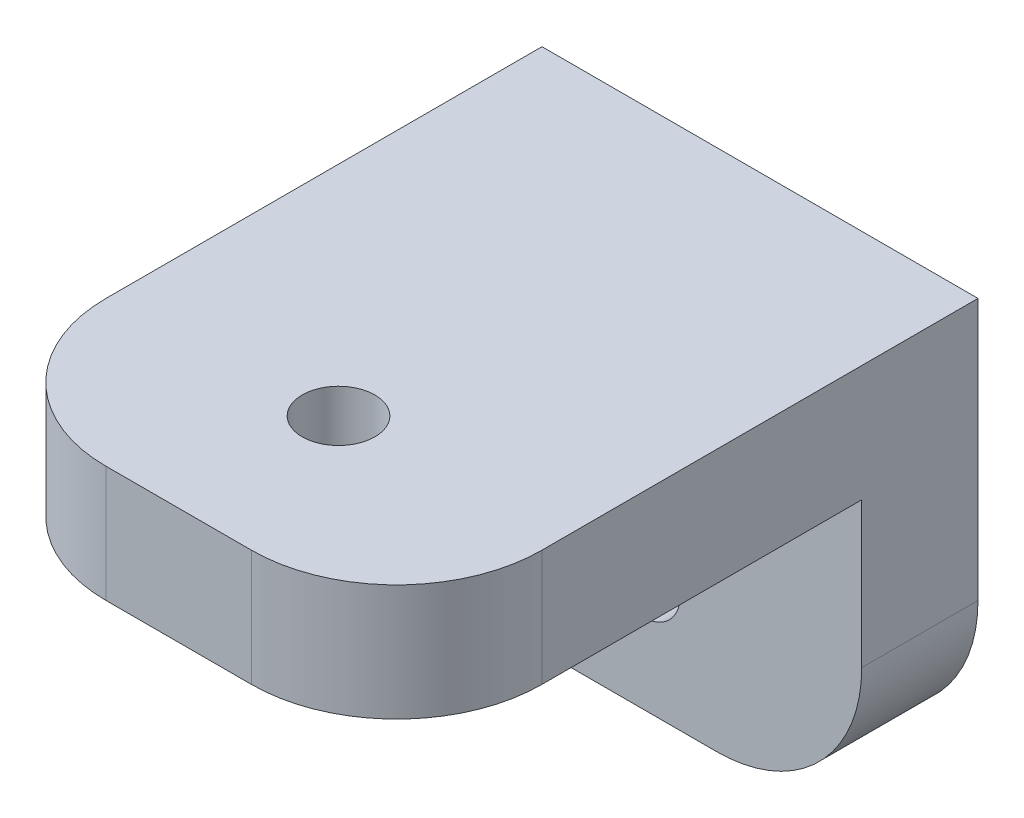
ISO-10303-21;
HEADER;
FILE_DESCRIPTION(('STEP AP214'),'2;1');
FILE_NAME('part.step','',(''),(''),'','','');
FILE_SCHEMA(('AUTOMOTIVE_DESIGN { 1 0 10303 214 1 1 1 1 }'));
ENDSEC;
DATA;
#1=APPLICATION_CONTEXT('core data for automotive mechanical design processes');
#2=APPLICATION_PROTOCOL_DEFINITION('international standard','automotive_design',2000,#1);
#3=PRODUCT_CONTEXT('',#1,'mechanical');
#4=PRODUCT('Part','Part','',(#3));
#5=PRODUCT_RELATED_PRODUCT_CATEGORY('part','',(#4));
#6=PRODUCT_DEFINITION_FORMATION('','',#4);
#7=PRODUCT_DEFINITION_CONTEXT('part definition',#1,'design');
#8=PRODUCT_DEFINITION('design','',#6,#7);
#9=PRODUCT_DEFINITION_SHAPE('','',#8);
#10=(LENGTH_UNIT() NAMED_UNIT(*) SI_UNIT(.MILLI.,.METRE.));
#11=(NAMED_UNIT(*) PLANE_ANGLE_UNIT() SI_UNIT($,.RADIAN.));
#12=(NAMED_UNIT(*) SI_UNIT($,.STERADIAN.) SOLID_ANGLE_UNIT());
#13=UNCERTAINTY_MEASURE_WITH_UNIT(LENGTH_MEASURE(1.E-05),#10,'distance_accuracy_value','');
#14=(GEOMETRIC_REPRESENTATION_CONTEXT(3) GLOBAL_UNCERTAINTY_ASSIGNED_CONTEXT((#13)) GLOBAL_UNIT_ASSIGNED_CONTEXT((#10,
#11,#12)) REPRESENTATION_CONTEXT('',''));
#15=CARTESIAN_POINT('',(0.,0.,0.));
#16=DIRECTION('',(0.,0.,1.));
#17=DIRECTION('',(1.,0.,0.));
#18=AXIS2_PLACEMENT_3D('',#15,#16,#17);
#19=CARTESIAN_POINT('',(0.,8.,0.));
#20=DIRECTION('',(1.,0.,0.));
#21=DIRECTION('',(0.,0.,-1.));
#22=AXIS2_PLACEMENT_3D('',#19,#20,#21);
#23=PLANE('',#22);
#24=DIRECTION('',(0.,-1.,0.));
#25=VECTOR('',#24,1.);
#26=CARTESIAN_POINT('',(0.,8.,-40.));
#27=LINE('',#26,#25);
#28=CARTESIAN_POINT('',(0.,8.,-40.));
#29=VERTEX_POINT('',#28);
#30=CARTESIAN_POINT('',(0.,-9.99999999999999,-40.));
#31=VERTEX_POINT('',#30);
#32=EDGE_CURVE('E172',#29,#31,#27,.T.);
#33=ORIENTED_EDGE('',*,*,#32,.T.);
#34=DIRECTION('',(0.,0.,-1.));
#35=VECTOR('',#34,1.);
#36=CARTESIAN_POINT('',(0.,-9.99999999999999,0.));
#37=LINE('',#36,#35);
#38=CARTESIAN_POINT('',(0.,-10.,-32.));
#39=VERTEX_POINT('',#38);
#40=EDGE_CURVE('E123',#31,#39,#37,.F.);
#41=ORIENTED_EDGE('',*,*,#40,.T.);
#42=DIRECTION('',(0.,1.,0.));
#43=VECTOR('',#42,1.);
#44=CARTESIAN_POINT('',(0.,-20.,-32.));
#45=LINE('',#44,#43);
#46=CARTESIAN_POINT('',(0.,0.,-32.));
#47=VERTEX_POINT('',#46);
#48=EDGE_CURVE('E117',#39,#47,#45,.T.);
#49=ORIENTED_EDGE('',*,*,#48,.T.);
#50=DIRECTION('',(0.,0.,1.));
#51=VECTOR('',#50,1.);
#52=CARTESIAN_POINT('',(0.,0.,0.));
#53=LINE('',#52,#51);
#54=CARTESIAN_POINT('',(0.,0.,-10.));
#55=VERTEX_POINT('',#54);
#56=EDGE_CURVE('E120',#47,#55,#53,.T.);
#57=ORIENTED_EDGE('',*,*,#56,.T.);
#58=DIRECTION('',(0.,-1.,0.));
#59=VECTOR('',#58,1.);
#60=CARTESIAN_POINT('',(0.,8.,-10.));
#61=LINE('',#60,#59);
#62=CARTESIAN_POINT('',(0.,8.,-10.));
#63=VERTEX_POINT('',#62);
#64=EDGE_CURVE('E216',#55,#63,#61,.F.);
#65=ORIENTED_EDGE('',*,*,#64,.T.);
#66=DIRECTION('',(0.,0.,1.));
#67=VECTOR('',#66,1.);
#68=CARTESIAN_POINT('',(0.,8.,0.));
#69=LINE('',#68,#67);
#70=EDGE_CURVE('E160',#29,#63,#69,.T.);
#71=ORIENTED_EDGE('',*,*,#70,.F.);
#72=EDGE_LOOP('',(#33,#41,#49,#57,#65,#71));
#73=FACE_BOUND('',#72,.T.);
#74=ADVANCED_FACE('F39',(#73),#23,.F.);
#75=CARTESIAN_POINT('',(0.,8.,0.));
#76=DIRECTION('',(0.,0.,-1.));
#77=DIRECTION('',(-1.,0.,0.));
#78=AXIS2_PLACEMENT_3D('',#75,#76,#77);
#79=PLANE('',#78);
#80=DIRECTION('',(1.,0.,0.));
#81=VECTOR('',#80,1.);
#82=CARTESIAN_POINT('',(0.,8.,0.));
#83=LINE('',#82,#81);
#84=CARTESIAN_POINT('',(10.,8.,0.));
#85=VERTEX_POINT('',#84);
#86=CARTESIAN_POINT('',(20.,8.,0.));
#87=VERTEX_POINT('',#86);
#88=EDGE_CURVE('E163',#85,#87,#83,.T.);
#89=ORIENTED_EDGE('',*,*,#88,.F.);
#90=DIRECTION('',(0.,-1.,0.));
#91=VECTOR('',#90,1.);
#92=CARTESIAN_POINT('',(10.,8.,0.));
#93=LINE('',#92,#91);
#94=CARTESIAN_POINT('',(10.,0.,0.));
#95=VERTEX_POINT('',#94);
#96=EDGE_CURVE('E223',#85,#95,#93,.T.);
#97=ORIENTED_EDGE('',*,*,#96,.T.);
#98=DIRECTION('',(1.,0.,0.));
#99=VECTOR('',#98,1.);
#100=CARTESIAN_POINT('',(0.,0.,0.));
#101=LINE('',#100,#99);
#102=CARTESIAN_POINT('',(20.,0.,0.));
#103=VERTEX_POINT('',#102);
#104=EDGE_CURVE('E139',#95,#103,#101,.T.);
#105=ORIENTED_EDGE('',*,*,#104,.T.);
#106=DIRECTION('',(0.,-1.,0.));
#107=VECTOR('',#106,1.);
#108=CARTESIAN_POINT('',(20.,8.,0.));
#109=LINE('',#108,#107);
#110=EDGE_CURVE('E55',#103,#87,#109,.F.);
#111=ORIENTED_EDGE('',*,*,#110,.T.);
#112=EDGE_LOOP('',(#89,#97,#105,#111));
#113=FACE_BOUND('',#112,.T.);
#114=ADVANCED_FACE('F241',(#113),#79,.F.);
#115=CARTESIAN_POINT('',(30.,8.,0.));
#116=DIRECTION('',(-1.,0.,0.));
#117=DIRECTION('',(0.,0.,1.));
#118=AXIS2_PLACEMENT_3D('',#115,#116,#117);
#119=PLANE('',#118);
#120=DIRECTION('',(0.,1.,0.));
#121=VECTOR('',#120,1.);
#122=CARTESIAN_POINT('',(30.,-20.,-32.));
#123=LINE('',#122,#121);
#124=CARTESIAN_POINT('',(30.,-10.,-32.));
#125=VERTEX_POINT('',#124);
#126=CARTESIAN_POINT('',(30.,0.,-32.));
#127=VERTEX_POINT('',#126);
#128=EDGE_CURVE('E128',#125,#127,#123,.T.);
#129=ORIENTED_EDGE('',*,*,#128,.F.);
#130=DIRECTION('',(0.,0.,1.));
#131=VECTOR('',#130,1.);
#132=CARTESIAN_POINT('',(30.,-9.99999999999999,0.));
#133=LINE('',#132,#131);
#134=CARTESIAN_POINT('',(30.,-9.99999999999999,-40.));
#135=VERTEX_POINT('',#134);
#136=EDGE_CURVE('E207',#125,#135,#133,.F.);
#137=ORIENTED_EDGE('',*,*,#136,.T.);
#138=DIRECTION('',(0.,-1.,0.));
#139=VECTOR('',#138,1.);
#140=CARTESIAN_POINT('',(30.,8.,-40.));
#141=LINE('',#140,#139);
#142=CARTESIAN_POINT('',(30.,8.,-40.));
#143=VERTEX_POINT('',#142);
#144=EDGE_CURVE('E180',#143,#135,#141,.T.);
#145=ORIENTED_EDGE('',*,*,#144,.F.);
#146=DIRECTION('',(0.,0.,-1.));
#147=VECTOR('',#146,1.);
#148=CARTESIAN_POINT('',(30.,8.,0.));
#149=LINE('',#148,#147);
#150=CARTESIAN_POINT('',(30.,8.,-10.));
#151=VERTEX_POINT('',#150);
#152=EDGE_CURVE('E167',#151,#143,#149,.T.);
#153=ORIENTED_EDGE('',*,*,#152,.F.);
#154=DIRECTION('',(0.,-1.,0.));
#155=VECTOR('',#154,1.);
#156=CARTESIAN_POINT('',(30.,8.,-10.));
#157=LINE('',#156,#155);
#158=CARTESIAN_POINT('',(30.,0.,-10.));
#159=VERTEX_POINT('',#158);
#160=EDGE_CURVE('E203',#151,#159,#157,.T.);
#161=ORIENTED_EDGE('',*,*,#160,.T.);
#162=DIRECTION('',(0.,0.,-1.));
#163=VECTOR('',#162,1.);
#164=CARTESIAN_POINT('',(30.,0.,0.));
#165=LINE('',#164,#163);
#166=EDGE_CURVE('E164',#159,#127,#165,.T.);
#167=ORIENTED_EDGE('',*,*,#166,.T.);
#168=EDGE_LOOP('',(#129,#137,#145,#153,#161,#167));
#169=FACE_BOUND('',#168,.T.);
#170=ADVANCED_FACE('F239',(#169),#119,.F.);
#171=CARTESIAN_POINT('',(0.,8.,-40.));
#172=DIRECTION('',(0.,0.,1.));
#173=DIRECTION('',(1.,0.,0.));
#174=AXIS2_PLACEMENT_3D('',#171,#172,#173);
#175=PLANE('',#174);
#176=CARTESIAN_POINT('',(15.,-12.,-40.));
#177=DIRECTION('',(0.,0.,-1.));
#178=DIRECTION('',(-1.,0.,0.));
#179=AXIS2_PLACEMENT_3D('',#176,#177,#178);
#180=CIRCLE('',#179,2.5);
#181=CARTESIAN_POINT('',(12.5,-12.,-40.));
#182=VERTEX_POINT('',#181);
#183=EDGE_CURVE('E189',#182,#182,#180,.T.);
#184=ORIENTED_EDGE('',*,*,#183,.F.);
#185=EDGE_LOOP('',(#184));
#186=FACE_BOUND('',#185,.T.);
#187=ORIENTED_EDGE('',*,*,#144,.T.);
#188=CARTESIAN_POINT('',(20.,-10.,-40.));
#189=DIRECTION('',(0.,0.,1.));
#190=DIRECTION('',(1.,0.,0.));
#191=AXIS2_PLACEMENT_3D('',#188,#189,#190);
#192=CIRCLE('',#191,10.);
#193=CARTESIAN_POINT('',(20.,-20.,-40.));
#194=VERTEX_POINT('',#193);
#195=EDGE_CURVE('E213',#135,#194,#192,.F.);
#196=ORIENTED_EDGE('',*,*,#195,.T.);
#197=DIRECTION('',(1.,0.,0.));
#198=VECTOR('',#197,1.);
#199=CARTESIAN_POINT('',(0.,-20.,-40.));
#200=LINE('',#199,#198);
#201=CARTESIAN_POINT('',(10.,-20.,-40.));
#202=VERTEX_POINT('',#201);
#203=EDGE_CURVE('E146',#202,#194,#200,.T.);
#204=ORIENTED_EDGE('',*,*,#203,.F.);
#205=CARTESIAN_POINT('',(10.,-10.,-40.));
#206=DIRECTION('',(0.,0.,1.));
#207=DIRECTION('',(1.,0.,0.));
#208=AXIS2_PLACEMENT_3D('',#205,#206,#207);
#209=CIRCLE('',#208,10.);
#210=EDGE_CURVE('E210',#202,#31,#209,.F.);
#211=ORIENTED_EDGE('',*,*,#210,.T.);
#212=ORIENTED_EDGE('',*,*,#32,.F.);
#213=DIRECTION('',(-1.,0.,0.));
#214=VECTOR('',#213,1.);
#215=CARTESIAN_POINT('',(0.,8.,-40.));
#216=LINE('',#215,#214);
#217=EDGE_CURVE('E170',#143,#29,#216,.T.);
#218=ORIENTED_EDGE('',*,*,#217,.F.);
#219=EDGE_LOOP('',(#187,#196,#204,#211,#212,#218));
#220=FACE_BOUND('',#219,.T.);
#221=ADVANCED_FACE('F248',(#186,#220),#175,.F.);
#222=CARTESIAN_POINT('',(0.,8.,0.));
#223=DIRECTION('',(0.,-1.,0.));
#224=DIRECTION('',(0.,0.,-1.));
#225=AXIS2_PLACEMENT_3D('',#222,#223,#224);
#226=PLANE('',#225);
#227=CARTESIAN_POINT('',(15.,8.,-11.));
#228=DIRECTION('',(0.,1.,0.));
#229=DIRECTION('',(0.,0.,1.));
#230=AXIS2_PLACEMENT_3D('',#227,#228,#229);
#231=CIRCLE('',#230,2.5);
#232=CARTESIAN_POINT('',(15.,8.,-8.5));
#233=VERTEX_POINT('',#232);
#234=EDGE_CURVE('E154',#233,#233,#231,.T.);
#235=ORIENTED_EDGE('',*,*,#234,.F.);
#236=EDGE_LOOP('',(#235));
#237=FACE_BOUND('',#236,.T.);
#238=ORIENTED_EDGE('',*,*,#70,.T.);
#239=CARTESIAN_POINT('',(10.,8.,-10.));
#240=DIRECTION('',(0.,-1.,0.));
#241=DIRECTION('',(0.,0.,-1.));
#242=AXIS2_PLACEMENT_3D('',#239,#240,#241);
#243=CIRCLE('',#242,10.);
#244=EDGE_CURVE('E11',#63,#85,#243,.F.);
#245=ORIENTED_EDGE('',*,*,#244,.T.);
#246=ORIENTED_EDGE('',*,*,#88,.T.);
#247=CARTESIAN_POINT('',(20.,8.,-10.));
#248=DIRECTION('',(0.,-1.,0.));
#249=DIRECTION('',(0.,0.,-1.));
#250=AXIS2_PLACEMENT_3D('',#247,#248,#249);
#251=CIRCLE('',#250,10.);
#252=EDGE_CURVE('E48',#87,#151,#251,.F.);
#253=ORIENTED_EDGE('',*,*,#252,.T.);
#254=ORIENTED_EDGE('',*,*,#152,.T.);
#255=ORIENTED_EDGE('',*,*,#217,.T.);
#256=EDGE_LOOP('',(#238,#245,#246,#253,#254,#255));
#257=FACE_BOUND('',#256,.T.);
#258=ADVANCED_FACE('F234',(#237,#257),#226,.F.);
#259=CARTESIAN_POINT('',(0.,0.,0.));
#260=DIRECTION('',(0.,-1.,0.));
#261=DIRECTION('',(0.,0.,-1.));
#262=AXIS2_PLACEMENT_3D('',#259,#260,#261);
#263=PLANE('',#262);
#264=CARTESIAN_POINT('',(15.,0.,-11.));
#265=DIRECTION('',(0.,-1.,0.));
#266=DIRECTION('',(0.,0.,-1.));
#267=AXIS2_PLACEMENT_3D('',#264,#265,#266);
#268=CIRCLE('',#267,2.5);
#269=CARTESIAN_POINT('',(15.,0.,-13.5));
#270=VERTEX_POINT('',#269);
#271=EDGE_CURVE('E147',#270,#270,#268,.T.);
#272=ORIENTED_EDGE('',*,*,#271,.F.);
#273=EDGE_LOOP('',(#272));
#274=FACE_BOUND('',#273,.T.);
#275=ORIENTED_EDGE('',*,*,#104,.F.);
#276=CARTESIAN_POINT('',(10.,0.,-10.));
#277=DIRECTION('',(0.,-1.,0.));
#278=DIRECTION('',(0.,0.,-1.));
#279=AXIS2_PLACEMENT_3D('',#276,#277,#278);
#280=CIRCLE('',#279,10.);
#281=EDGE_CURVE('E137',#95,#55,#280,.T.);
#282=ORIENTED_EDGE('',*,*,#281,.T.);
#283=ORIENTED_EDGE('',*,*,#56,.F.);
#284=DIRECTION('',(-1.,0.,0.));
#285=VECTOR('',#284,1.);
#286=CARTESIAN_POINT('',(0.,0.,-32.));
#287=LINE('',#286,#285);
#288=EDGE_CURVE('E136',#127,#47,#287,.T.);
#289=ORIENTED_EDGE('',*,*,#288,.F.);
#290=ORIENTED_EDGE('',*,*,#166,.F.);
#291=CARTESIAN_POINT('',(20.,0.,-10.));
#292=DIRECTION('',(0.,-1.,0.));
#293=DIRECTION('',(0.,0.,-1.));
#294=AXIS2_PLACEMENT_3D('',#291,#292,#293);
#295=CIRCLE('',#294,10.);
#296=EDGE_CURVE('E227',#159,#103,#295,.T.);
#297=ORIENTED_EDGE('',*,*,#296,.T.);
#298=EDGE_LOOP('',(#275,#282,#283,#289,#290,#297));
#299=FACE_BOUND('',#298,.T.);
#300=ADVANCED_FACE('F134',(#274,#299),#263,.T.);
#301=CARTESIAN_POINT('',(0.,-20.,-32.));
#302=DIRECTION('',(0.,0.,-1.));
#303=DIRECTION('',(-1.,0.,0.));
#304=AXIS2_PLACEMENT_3D('',#301,#302,#303);
#305=PLANE('',#304);
#306=CARTESIAN_POINT('',(15.,-12.,-32.));
#307=DIRECTION('',(0.,0.,-1.));
#308=DIRECTION('',(-1.,0.,0.));
#309=AXIS2_PLACEMENT_3D('',#306,#307,#308);
#310=CIRCLE('',#309,2.5);
#311=CARTESIAN_POINT('',(12.5,-12.,-32.));
#312=VERTEX_POINT('',#311);
#313=EDGE_CURVE('E185',#312,#312,#310,.T.);
#314=ORIENTED_EDGE('',*,*,#313,.T.);
#315=EDGE_LOOP('',(#314));
#316=FACE_BOUND('',#315,.T.);
#317=DIRECTION('',(-1.,0.,0.));
#318=VECTOR('',#317,1.);
#319=CARTESIAN_POINT('',(0.,-20.,-32.));
#320=LINE('',#319,#318);
#321=CARTESIAN_POINT('',(20.,-20.,-32.));
#322=VERTEX_POINT('',#321);
#323=CARTESIAN_POINT('',(10.,-20.,-32.));
#324=VERTEX_POINT('',#323);
#325=EDGE_CURVE('E129',#322,#324,#320,.T.);
#326=ORIENTED_EDGE('',*,*,#325,.F.);
#327=CARTESIAN_POINT('',(20.,-10.,-32.));
#328=DIRECTION('',(0.,0.,-1.));
#329=DIRECTION('',(-1.,0.,0.));
#330=AXIS2_PLACEMENT_3D('',#327,#328,#329);
#331=CIRCLE('',#330,10.);
#332=EDGE_CURVE('E200',#322,#125,#331,.F.);
#333=ORIENTED_EDGE('',*,*,#332,.T.);
#334=ORIENTED_EDGE('',*,*,#128,.T.);
#335=ORIENTED_EDGE('',*,*,#288,.T.);
#336=ORIENTED_EDGE('',*,*,#48,.F.);
#337=CARTESIAN_POINT('',(10.,-10.,-32.));
#338=DIRECTION('',(0.,0.,-1.));
#339=DIRECTION('',(-1.,0.,0.));
#340=AXIS2_PLACEMENT_3D('',#337,#338,#339);
#341=CIRCLE('',#340,10.);
#342=EDGE_CURVE('E197',#39,#324,#341,.F.);
#343=ORIENTED_EDGE('',*,*,#342,.T.);
#344=EDGE_LOOP('',(#326,#333,#334,#335,#336,#343));
#345=FACE_BOUND('',#344,.T.);
#346=ADVANCED_FACE('F143',(#316,#345),#305,.F.);
#347=CARTESIAN_POINT('',(0.,-20.,0.));
#348=DIRECTION('',(0.,1.,0.));
#349=DIRECTION('',(0.,0.,1.));
#350=AXIS2_PLACEMENT_3D('',#347,#348,#349);
#351=PLANE('',#350);
#352=ORIENTED_EDGE('',*,*,#203,.T.);
#353=DIRECTION('',(0.,0.,1.));
#354=VECTOR('',#353,1.);
#355=CARTESIAN_POINT('',(20.,-20.,0.));
#356=LINE('',#355,#354);
#357=EDGE_CURVE('E193',#194,#322,#356,.T.);
#358=ORIENTED_EDGE('',*,*,#357,.T.);
#359=ORIENTED_EDGE('',*,*,#325,.T.);
#360=DIRECTION('',(0.,0.,-1.));
#361=VECTOR('',#360,1.);
#362=CARTESIAN_POINT('',(10.,-20.,0.));
#363=LINE('',#362,#361);
#364=EDGE_CURVE('E183',#324,#202,#363,.T.);
#365=ORIENTED_EDGE('',*,*,#364,.T.);
#366=EDGE_LOOP('',(#352,#358,#359,#365));
#367=FACE_BOUND('',#366,.T.);
#368=ADVANCED_FACE('F255',(#367),#351,.F.);
#369=CARTESIAN_POINT('',(15.,-2.,-11.));
#370=DIRECTION('',(0.,1.,0.));
#371=DIRECTION('',(0.,0.,1.));
#372=AXIS2_PLACEMENT_3D('',#369,#370,#371);
#373=CYLINDRICAL_SURFACE('',#372,2.5);
#374=ORIENTED_EDGE('',*,*,#271,.T.);
#375=EDGE_LOOP('',(#374));
#376=FACE_BOUND('',#375,.T.);
#377=ORIENTED_EDGE('',*,*,#234,.T.);
#378=EDGE_LOOP('',(#377));
#379=FACE_BOUND('',#378,.T.);
#380=ADVANCED_FACE('F270',(#376,#379),#373,.F.);
#381=CARTESIAN_POINT('',(15.,-12.,-30.));
#382=DIRECTION('',(0.,0.,-1.));
#383=DIRECTION('',(-1.,0.,0.));
#384=AXIS2_PLACEMENT_3D('',#381,#382,#383);
#385=CYLINDRICAL_SURFACE('',#384,2.5);
#386=ORIENTED_EDGE('',*,*,#183,.T.);
#387=EDGE_LOOP('',(#386));
#388=FACE_BOUND('',#387,.T.);
#389=ORIENTED_EDGE('',*,*,#313,.F.);
#390=EDGE_LOOP('',(#389));
#391=FACE_BOUND('',#390,.T.);
#392=ADVANCED_FACE('F263',(#388,#391),#385,.F.);
#393=CARTESIAN_POINT('',(20.,-10.,0.));
#394=DIRECTION('',(0.,0.,1.));
#395=DIRECTION('',(1.,0.,0.));
#396=AXIS2_PLACEMENT_3D('',#393,#394,#395);
#397=CYLINDRICAL_SURFACE('',#396,10.);
#398=ORIENTED_EDGE('',*,*,#195,.F.);
#399=ORIENTED_EDGE('',*,*,#136,.F.);
#400=ORIENTED_EDGE('',*,*,#332,.F.);
#401=ORIENTED_EDGE('',*,*,#357,.F.);
#402=EDGE_LOOP('',(#398,#399,#400,#401));
#403=FACE_BOUND('',#402,.T.);
#404=ADVANCED_FACE('F260',(#403),#397,.T.);
#405=CARTESIAN_POINT('',(10.,-10.,0.));
#406=DIRECTION('',(0.,0.,-1.));
#407=DIRECTION('',(-1.,0.,0.));
#408=AXIS2_PLACEMENT_3D('',#405,#406,#407);
#409=CYLINDRICAL_SURFACE('',#408,10.);
#410=ORIENTED_EDGE('',*,*,#342,.F.);
#411=ORIENTED_EDGE('',*,*,#40,.F.);
#412=ORIENTED_EDGE('',*,*,#210,.F.);
#413=ORIENTED_EDGE('',*,*,#364,.F.);
#414=EDGE_LOOP('',(#410,#411,#412,#413));
#415=FACE_BOUND('',#414,.T.);
#416=ADVANCED_FACE('F251',(#415),#409,.T.);
#417=CARTESIAN_POINT('',(10.,8.,-10.));
#418=DIRECTION('',(0.,-1.,0.));
#419=DIRECTION('',(0.,0.,-1.));
#420=AXIS2_PLACEMENT_3D('',#417,#418,#419);
#421=CYLINDRICAL_SURFACE('',#420,10.);
#422=ORIENTED_EDGE('',*,*,#244,.F.);
#423=ORIENTED_EDGE('',*,*,#64,.F.);
#424=ORIENTED_EDGE('',*,*,#281,.F.);
#425=ORIENTED_EDGE('',*,*,#96,.F.);
#426=EDGE_LOOP('',(#422,#423,#424,#425));
#427=FACE_BOUND('',#426,.T.);
#428=ADVANCED_FACE('F244',(#427),#421,.T.);
#429=CARTESIAN_POINT('',(20.,8.,-10.));
#430=DIRECTION('',(0.,-1.,0.));
#431=DIRECTION('',(0.,0.,-1.));
#432=AXIS2_PLACEMENT_3D('',#429,#430,#431);
#433=CYLINDRICAL_SURFACE('',#432,10.);
#434=ORIENTED_EDGE('',*,*,#252,.F.);
#435=ORIENTED_EDGE('',*,*,#110,.F.);
#436=ORIENTED_EDGE('',*,*,#296,.F.);
#437=ORIENTED_EDGE('',*,*,#160,.F.);
#438=EDGE_LOOP('',(#434,#435,#436,#437));
#439=FACE_BOUND('',#438,.T.);
#440=ADVANCED_FACE('F41',(#439),#433,.T.);
#441=CLOSED_SHELL('',(#74,#114,#170,#221,#258,#300,#346,#368,#380,#392,#404,#416,#428,#440));
#442=MANIFOLD_SOLID_BREP('B2',#441);
#443=ADVANCED_BREP_SHAPE_REPRESENTATION('',(#18,#442),#14);
#444=SHAPE_DEFINITION_REPRESENTATION(#9,#443);
ENDSEC;
END-ISO-10303-21;
